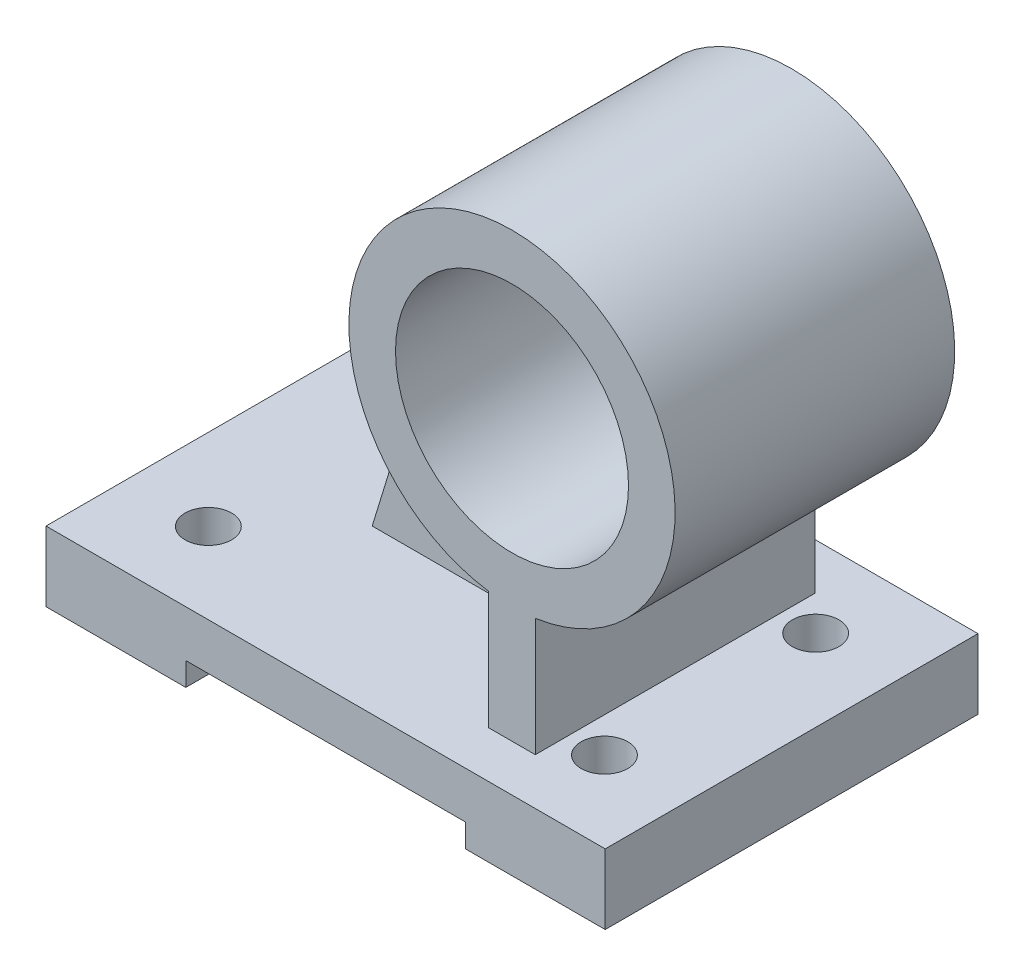
ISO-10303-21;
HEADER;
FILE_DESCRIPTION(('STEP AP214'),'2;1');
FILE_NAME('part.step','',(''),(''),'','','');
FILE_SCHEMA(('AUTOMOTIVE_DESIGN { 1 0 10303 214 1 1 1 1 }'));
ENDSEC;
DATA;
#1=APPLICATION_CONTEXT('core data for automotive mechanical design processes');
#2=APPLICATION_PROTOCOL_DEFINITION('international standard','automotive_design',2000,#1);
#3=PRODUCT_CONTEXT('',#1,'mechanical');
#4=PRODUCT('Part','Part','',(#3));
#5=PRODUCT_RELATED_PRODUCT_CATEGORY('part','',(#4));
#6=PRODUCT_DEFINITION_FORMATION('','',#4);
#7=PRODUCT_DEFINITION_CONTEXT('part definition',#1,'design');
#8=PRODUCT_DEFINITION('design','',#6,#7);
#9=PRODUCT_DEFINITION_SHAPE('','',#8);
#10=(LENGTH_UNIT() NAMED_UNIT(*) SI_UNIT(.MILLI.,.METRE.));
#11=(NAMED_UNIT(*) PLANE_ANGLE_UNIT() SI_UNIT($,.RADIAN.));
#12=(NAMED_UNIT(*) SI_UNIT($,.STERADIAN.) SOLID_ANGLE_UNIT());
#13=UNCERTAINTY_MEASURE_WITH_UNIT(LENGTH_MEASURE(1.E-05),#10,'distance_accuracy_value','');
#14=(GEOMETRIC_REPRESENTATION_CONTEXT(3) GLOBAL_UNCERTAINTY_ASSIGNED_CONTEXT((#13)) GLOBAL_UNIT_ASSIGNED_CONTEXT((#10,
#11,#12)) REPRESENTATION_CONTEXT('',''));
#15=CARTESIAN_POINT('',(0.,0.,0.));
#16=DIRECTION('',(0.,0.,1.));
#17=DIRECTION('',(1.,0.,0.));
#18=AXIS2_PLACEMENT_3D('',#15,#16,#17);
#19=CARTESIAN_POINT('',(25.,7.5,0.));
#20=DIRECTION('',(-1.,0.,0.));
#21=DIRECTION('',(0.,-1.,0.));
#22=AXIS2_PLACEMENT_3D('',#19,#20,#21);
#23=PLANE('',#22);
#24=DIRECTION('',(0.,0.,1.));
#25=VECTOR('',#24,1.);
#26=CARTESIAN_POINT('',(25.,7.5,0.));
#27=LINE('',#26,#25);
#28=CARTESIAN_POINT('',(25.,7.5,-30.));
#29=VERTEX_POINT('',#28);
#30=CARTESIAN_POINT('',(25.,7.5,-5.));
#31=VERTEX_POINT('',#30);
#32=EDGE_CURVE('E305',#29,#31,#27,.T.);
#33=ORIENTED_EDGE('',*,*,#32,.T.);
#34=DIRECTION('',(0.,1.,0.));
#35=VECTOR('',#34,1.);
#36=CARTESIAN_POINT('',(25.,7.5,-5.));
#37=LINE('',#36,#35);
#38=CARTESIAN_POINT('',(25.,32.8589838486224,-5.));
#39=VERTEX_POINT('',#38);
#40=EDGE_CURVE('E172',#31,#39,#37,.T.);
#41=ORIENTED_EDGE('',*,*,#40,.T.);
#42=DIRECTION('',(0.,0.,-1.));
#43=VECTOR('',#42,1.);
#44=CARTESIAN_POINT('',(25.,32.8589838486224,30.));
#45=LINE('',#44,#43);
#46=CARTESIAN_POINT('',(25.,32.8589838486224,-30.));
#47=VERTEX_POINT('',#46);
#48=EDGE_CURVE('E299',#39,#47,#45,.T.);
#49=ORIENTED_EDGE('',*,*,#48,.T.);
#50=DIRECTION('',(0.,1.,0.));
#51=VECTOR('',#50,1.);
#52=CARTESIAN_POINT('',(25.,65.9644736669432,-30.));
#53=LINE('',#52,#51);
#54=EDGE_CURVE('E289',#47,#29,#53,.F.);
#55=ORIENTED_EDGE('',*,*,#54,.T.);
#56=EDGE_LOOP('',(#33,#41,#49,#55));
#57=FACE_BOUND('',#56,.T.);
#58=ADVANCED_FACE('F39',(#57),#23,.T.);
#59=CARTESIAN_POINT('',(30.,67.5,-30.));
#60=DIRECTION('',(0.,0.,-1.));
#61=DIRECTION('',(-1.,0.,0.));
#62=AXIS2_PLACEMENT_3D('',#59,#60,#61);
#63=PLANE('',#62);
#64=CARTESIAN_POINT('',(30.,67.5,-30.));
#65=DIRECTION('',(0.,0.,1.));
#66=DIRECTION('',(1.,0.,0.));
#67=AXIS2_PLACEMENT_3D('',#64,#65,#66);
#68=CIRCLE('',#67,25.);
#69=CARTESIAN_POINT('',(55.,67.5,-30.));
#70=VERTEX_POINT('',#69);
#71=EDGE_CURVE('E420',#70,#70,#68,.T.);
#72=ORIENTED_EDGE('',*,*,#71,.T.);
#73=EDGE_LOOP('',(#72));
#74=FACE_BOUND('',#73,.T.);
#75=CARTESIAN_POINT('',(30.,67.5,-30.));
#76=DIRECTION('',(0.,0.,-1.));
#77=DIRECTION('',(-1.,0.,0.));
#78=AXIS2_PLACEMENT_3D('',#75,#76,#77);
#79=CIRCLE('',#78,35.);
#80=CARTESIAN_POINT('',(35.,32.8589838486224,-30.));
#81=VERTEX_POINT('',#80);
#82=EDGE_CURVE('E43',#47,#81,#79,.T.);
#83=ORIENTED_EDGE('',*,*,#82,.T.);
#84=DIRECTION('',(0.,1.,0.));
#85=VECTOR('',#84,1.);
#86=CARTESIAN_POINT('',(35.,65.9644736669432,-30.));
#87=LINE('',#86,#85);
#88=CARTESIAN_POINT('',(35.,7.5,-30.));
#89=VERTEX_POINT('',#88);
#90=EDGE_CURVE('E273',#89,#81,#87,.T.);
#91=ORIENTED_EDGE('',*,*,#90,.F.);
#92=DIRECTION('',(1.,0.,0.));
#93=VECTOR('',#92,1.);
#94=CARTESIAN_POINT('',(30.,7.5,-30.));
#95=LINE('',#94,#93);
#96=EDGE_CURVE('E49',#29,#89,#95,.T.);
#97=ORIENTED_EDGE('',*,*,#96,.F.);
#98=ORIENTED_EDGE('',*,*,#54,.F.);
#99=EDGE_LOOP('',(#83,#91,#97,#98));
#100=FACE_BOUND('',#99,.T.);
#101=ADVANCED_FACE('F326',(#74,#100),#63,.T.);
#102=CARTESIAN_POINT('',(35.,7.5,0.));
#103=DIRECTION('',(1.,0.,0.));
#104=DIRECTION('',(0.,1.,0.));
#105=AXIS2_PLACEMENT_3D('',#102,#103,#104);
#106=PLANE('',#105);
#107=DIRECTION('',(0.,1.,0.));
#108=VECTOR('',#107,1.);
#109=CARTESIAN_POINT('',(35.,65.9644736669432,30.));
#110=LINE('',#109,#108);
#111=CARTESIAN_POINT('',(35.,7.5,30.));
#112=VERTEX_POINT('',#111);
#113=CARTESIAN_POINT('',(35.,32.8589838486224,30.));
#114=VERTEX_POINT('',#113);
#115=EDGE_CURVE('E284',#112,#114,#110,.T.);
#116=ORIENTED_EDGE('',*,*,#115,.F.);
#117=DIRECTION('',(0.,0.,1.));
#118=VECTOR('',#117,1.);
#119=CARTESIAN_POINT('',(35.,7.5,0.));
#120=LINE('',#119,#118);
#121=EDGE_CURVE('E11',#89,#112,#120,.T.);
#122=ORIENTED_EDGE('',*,*,#121,.F.);
#123=ORIENTED_EDGE('',*,*,#90,.T.);
#124=DIRECTION('',(0.,0.,-1.));
#125=VECTOR('',#124,1.);
#126=CARTESIAN_POINT('',(35.,32.8589838486224,30.));
#127=LINE('',#126,#125);
#128=EDGE_CURVE('E315',#81,#114,#127,.F.);
#129=ORIENTED_EDGE('',*,*,#128,.T.);
#130=EDGE_LOOP('',(#116,#122,#123,#129));
#131=FACE_BOUND('',#130,.T.);
#132=ADVANCED_FACE('F331',(#131),#106,.T.);
#133=DIRECTION('',(0.,1.,0.));
#134=VECTOR('',#133,1.);
#135=CARTESIAN_POINT('',(25.,7.5,5.));
#136=LINE('',#135,#134);
#137=CARTESIAN_POINT('',(25.,7.5,5.));
#138=VERTEX_POINT('',#137);
#139=CARTESIAN_POINT('',(25.,32.8589838486224,5.));
#140=VERTEX_POINT('',#139);
#141=EDGE_CURVE('E195',#138,#140,#136,.T.);
#142=ORIENTED_EDGE('',*,*,#141,.F.);
#143=CARTESIAN_POINT('',(25.,7.5,30.));
#144=VERTEX_POINT('',#143);
#145=EDGE_CURVE('E294',#138,#144,#27,.T.);
#146=ORIENTED_EDGE('',*,*,#145,.T.);
#147=DIRECTION('',(0.,1.,0.));
#148=VECTOR('',#147,1.);
#149=CARTESIAN_POINT('',(25.,65.9644736669432,30.));
#150=LINE('',#149,#148);
#151=CARTESIAN_POINT('',(25.,32.8589838486224,30.));
#152=VERTEX_POINT('',#151);
#153=EDGE_CURVE('E288',#152,#144,#150,.F.);
#154=ORIENTED_EDGE('',*,*,#153,.F.);
#155=EDGE_CURVE('E311',#152,#140,#45,.T.);
#156=ORIENTED_EDGE('',*,*,#155,.T.);
#157=EDGE_LOOP('',(#142,#146,#154,#156));
#158=FACE_BOUND('',#157,.T.);
#159=ADVANCED_FACE('F334',(#158),#23,.T.);
#160=CARTESIAN_POINT('',(30.,67.5,30.));
#161=DIRECTION('',(0.,0.,-1.));
#162=DIRECTION('',(-1.,0.,0.));
#163=AXIS2_PLACEMENT_3D('',#160,#161,#162);
#164=CYLINDRICAL_SURFACE('',#163,35.);
#165=CARTESIAN_POINT('',(30.,67.5,30.));
#166=DIRECTION('',(0.,0.,-1.));
#167=DIRECTION('',(-1.,0.,0.));
#168=AXIS2_PLACEMENT_3D('',#165,#166,#167);
#169=CIRCLE('',#168,35.);
#170=EDGE_CURVE('E295',#152,#114,#169,.T.);
#171=ORIENTED_EDGE('',*,*,#170,.T.);
#172=ORIENTED_EDGE('',*,*,#128,.F.);
#173=ORIENTED_EDGE('',*,*,#82,.F.);
#174=ORIENTED_EDGE('',*,*,#48,.F.);
#175=CARTESIAN_POINT('',(30.,67.5,-5.));
#176=DIRECTION('',(0.,0.,1.));
#177=DIRECTION('',(1.,0.,0.));
#178=AXIS2_PLACEMENT_3D('',#175,#176,#177);
#179=CIRCLE('',#178,35.);
#180=CARTESIAN_POINT('',(-3.46307227099476,77.7578162484118,-5.));
#181=VERTEX_POINT('',#180);
#182=EDGE_CURVE('E62',#39,#181,#179,.F.);
#183=ORIENTED_EDGE('',*,*,#182,.T.);
#184=DIRECTION('',(0.,0.,-1.));
#185=VECTOR('',#184,1.);
#186=CARTESIAN_POINT('',(-3.46307227099475,77.7578162484118,30.));
#187=LINE('',#186,#185);
#188=CARTESIAN_POINT('',(-3.46307227099476,77.7578162484118,5.));
#189=VERTEX_POINT('',#188);
#190=EDGE_CURVE('E57',#189,#181,#187,.T.);
#191=ORIENTED_EDGE('',*,*,#190,.F.);
#192=CARTESIAN_POINT('',(30.,67.5,5.));
#193=DIRECTION('',(0.,0.,1.));
#194=DIRECTION('',(1.,0.,0.));
#195=AXIS2_PLACEMENT_3D('',#192,#193,#194);
#196=CIRCLE('',#195,35.);
#197=EDGE_CURVE('E174',#140,#189,#196,.F.);
#198=ORIENTED_EDGE('',*,*,#197,.F.);
#199=ORIENTED_EDGE('',*,*,#155,.F.);
#200=EDGE_LOOP('',(#171,#172,#173,#174,#183,#191,#198,#199));
#201=FACE_BOUND('',#200,.T.);
#202=ADVANCED_FACE('F41',(#201),#164,.T.);
#203=CARTESIAN_POINT('',(30.,67.5,30.));
#204=DIRECTION('',(0.,0.,-1.));
#205=DIRECTION('',(-1.,0.,0.));
#206=AXIS2_PLACEMENT_3D('',#203,#204,#205);
#207=PLANE('',#206);
#208=CARTESIAN_POINT('',(30.,67.5,30.));
#209=DIRECTION('',(0.,0.,1.));
#210=DIRECTION('',(1.,0.,0.));
#211=AXIS2_PLACEMENT_3D('',#208,#209,#210);
#212=CIRCLE('',#211,25.);
#213=CARTESIAN_POINT('',(55.,67.5,30.));
#214=VERTEX_POINT('',#213);
#215=EDGE_CURVE('E423',#214,#214,#212,.T.);
#216=ORIENTED_EDGE('',*,*,#215,.F.);
#217=EDGE_LOOP('',(#216));
#218=FACE_BOUND('',#217,.T.);
#219=ORIENTED_EDGE('',*,*,#170,.F.);
#220=ORIENTED_EDGE('',*,*,#153,.T.);
#221=DIRECTION('',(1.,0.,0.));
#222=VECTOR('',#221,1.);
#223=CARTESIAN_POINT('',(30.,7.5,30.));
#224=LINE('',#223,#222);
#225=EDGE_CURVE('E290',#144,#112,#224,.T.);
#226=ORIENTED_EDGE('',*,*,#225,.T.);
#227=ORIENTED_EDGE('',*,*,#115,.T.);
#228=EDGE_LOOP('',(#219,#220,#226,#227));
#229=FACE_BOUND('',#228,.T.);
#230=ADVANCED_FACE('F333',(#218,#229),#207,.F.);
#231=CARTESIAN_POINT('',(-60.,7.5,40.));
#232=DIRECTION('',(0.,-1.,0.));
#233=DIRECTION('',(0.,0.,-1.));
#234=AXIS2_PLACEMENT_3D('',#231,#232,#233);
#235=PLANE('',#234);
#236=CARTESIAN_POINT('',(42.5,7.5,-22.6578896149476));
#237=DIRECTION('',(0.,1.,0.));
#238=DIRECTION('',(0.,0.,-1.));
#239=AXIS2_PLACEMENT_3D('',#236,#237,#238);
#240=CIRCLE('',#239,5.);
#241=CARTESIAN_POINT('',(42.5,7.5,-27.6578896149476));
#242=VERTEX_POINT('',#241);
#243=EDGE_CURVE('E427',#242,#242,#240,.T.);
#244=ORIENTED_EDGE('',*,*,#243,.F.);
#245=EDGE_LOOP('',(#244));
#246=FACE_BOUND('',#245,.T.);
#247=CARTESIAN_POINT('',(42.5,7.5,22.6578896149476));
#248=DIRECTION('',(0.,-1.,0.));
#249=DIRECTION('',(0.,0.,1.));
#250=AXIS2_PLACEMENT_3D('',#247,#248,#249);
#251=CIRCLE('',#250,5.);
#252=CARTESIAN_POINT('',(42.5,7.5,27.6578896149476));
#253=VERTEX_POINT('',#252);
#254=EDGE_CURVE('E434',#253,#253,#251,.T.);
#255=ORIENTED_EDGE('',*,*,#254,.T.);
#256=EDGE_LOOP('',(#255));
#257=FACE_BOUND('',#256,.T.);
#258=CARTESIAN_POINT('',(-42.5,7.5,-22.6578896149476));
#259=DIRECTION('',(0.,-1.,0.));
#260=DIRECTION('',(0.,0.,-1.));
#261=AXIS2_PLACEMENT_3D('',#258,#259,#260);
#262=CIRCLE('',#261,5.);
#263=CARTESIAN_POINT('',(-42.5,7.5,-27.6578896149476));
#264=VERTEX_POINT('',#263);
#265=EDGE_CURVE('E442',#264,#264,#262,.T.);
#266=ORIENTED_EDGE('',*,*,#265,.T.);
#267=EDGE_LOOP('',(#266));
#268=FACE_BOUND('',#267,.T.);
#269=CARTESIAN_POINT('',(-42.5,7.5,22.6578896149476));
#270=DIRECTION('',(0.,1.,0.));
#271=DIRECTION('',(0.,0.,1.));
#272=AXIS2_PLACEMENT_3D('',#269,#270,#271);
#273=CIRCLE('',#272,5.);
#274=CARTESIAN_POINT('',(-42.5,7.5,27.6578896149476));
#275=VERTEX_POINT('',#274);
#276=EDGE_CURVE('E185',#275,#275,#273,.T.);
#277=ORIENTED_EDGE('',*,*,#276,.F.);
#278=EDGE_LOOP('',(#277));
#279=FACE_BOUND('',#278,.T.);
#280=ORIENTED_EDGE('',*,*,#121,.T.);
#281=ORIENTED_EDGE('',*,*,#225,.F.);
#282=ORIENTED_EDGE('',*,*,#145,.F.);
#283=DIRECTION('',(-1.,0.,0.));
#284=VECTOR('',#283,1.);
#285=CARTESIAN_POINT('',(-60.,7.5,5.));
#286=LINE('',#285,#284);
#287=CARTESIAN_POINT('',(-25.,7.5,5.));
#288=VERTEX_POINT('',#287);
#289=EDGE_CURVE('E160',#138,#288,#286,.T.);
#290=ORIENTED_EDGE('',*,*,#289,.T.);
#291=DIRECTION('',(0.,0.,1.));
#292=VECTOR('',#291,1.);
#293=CARTESIAN_POINT('',(-25.,7.5,40.));
#294=LINE('',#293,#292);
#295=CARTESIAN_POINT('',(-25.,7.5,-5.));
#296=VERTEX_POINT('',#295);
#297=EDGE_CURVE('E152',#288,#296,#294,.F.);
#298=ORIENTED_EDGE('',*,*,#297,.T.);
#299=DIRECTION('',(-1.,0.,0.));
#300=VECTOR('',#299,1.);
#301=CARTESIAN_POINT('',(-60.,7.5,-5.));
#302=LINE('',#301,#300);
#303=EDGE_CURVE('E156',#31,#296,#302,.T.);
#304=ORIENTED_EDGE('',*,*,#303,.F.);
#305=ORIENTED_EDGE('',*,*,#32,.F.);
#306=ORIENTED_EDGE('',*,*,#96,.T.);
#307=EDGE_LOOP('',(#280,#281,#282,#290,#298,#304,#305,#306));
#308=FACE_BOUND('',#307,.T.);
#309=DIRECTION('',(0.,0.,-1.));
#310=VECTOR('',#309,1.);
#311=CARTESIAN_POINT('',(60.,7.5,40.));
#312=LINE('',#311,#310);
#313=CARTESIAN_POINT('',(60.,7.5,40.));
#314=VERTEX_POINT('',#313);
#315=CARTESIAN_POINT('',(60.,7.5,-40.));
#316=VERTEX_POINT('',#315);
#317=EDGE_CURVE('E203',#314,#316,#312,.T.);
#318=ORIENTED_EDGE('',*,*,#317,.T.);
#319=DIRECTION('',(-1.,0.,0.));
#320=VECTOR('',#319,1.);
#321=CARTESIAN_POINT('',(-60.,7.5,-40.));
#322=LINE('',#321,#320);
#323=CARTESIAN_POINT('',(-60.,7.5,-40.));
#324=VERTEX_POINT('',#323);
#325=EDGE_CURVE('E227',#316,#324,#322,.T.);
#326=ORIENTED_EDGE('',*,*,#325,.T.);
#327=DIRECTION('',(0.,0.,-1.));
#328=VECTOR('',#327,1.);
#329=CARTESIAN_POINT('',(-60.,7.5,40.));
#330=LINE('',#329,#328);
#331=CARTESIAN_POINT('',(-60.,7.5,40.));
#332=VERTEX_POINT('',#331);
#333=EDGE_CURVE('E206',#332,#324,#330,.T.);
#334=ORIENTED_EDGE('',*,*,#333,.F.);
#335=DIRECTION('',(-1.,0.,0.));
#336=VECTOR('',#335,1.);
#337=CARTESIAN_POINT('',(-60.,7.5,40.));
#338=LINE('',#337,#336);
#339=EDGE_CURVE('E242',#314,#332,#338,.T.);
#340=ORIENTED_EDGE('',*,*,#339,.F.);
#341=EDGE_LOOP('',(#318,#326,#334,#340));
#342=FACE_BOUND('',#341,.T.);
#343=ADVANCED_FACE('F154',(#246,#257,#268,#279,#308,#342),#235,.F.);
#344=CARTESIAN_POINT('',(-60.,-7.5,40.));
#345=DIRECTION('',(0.,1.,0.));
#346=DIRECTION('',(0.,0.,1.));
#347=AXIS2_PLACEMENT_3D('',#344,#345,#346);
#348=PLANE('',#347);
#349=CARTESIAN_POINT('',(42.5,-7.5,-22.6578896149476));
#350=DIRECTION('',(0.,1.,0.));
#351=DIRECTION('',(0.,0.,-1.));
#352=AXIS2_PLACEMENT_3D('',#349,#350,#351);
#353=CIRCLE('',#352,5.);
#354=CARTESIAN_POINT('',(42.5,-7.5,-27.6578896149476));
#355=VERTEX_POINT('',#354);
#356=EDGE_CURVE('E430',#355,#355,#353,.T.);
#357=ORIENTED_EDGE('',*,*,#356,.T.);
#358=EDGE_LOOP('',(#357));
#359=FACE_BOUND('',#358,.T.);
#360=CARTESIAN_POINT('',(42.5,-7.5,22.6578896149476));
#361=DIRECTION('',(0.,-1.,0.));
#362=DIRECTION('',(0.,0.,1.));
#363=AXIS2_PLACEMENT_3D('',#360,#361,#362);
#364=CIRCLE('',#363,5.);
#365=CARTESIAN_POINT('',(42.5,-7.5,27.6578896149476));
#366=VERTEX_POINT('',#365);
#367=EDGE_CURVE('E438',#366,#366,#364,.T.);
#368=ORIENTED_EDGE('',*,*,#367,.F.);
#369=EDGE_LOOP('',(#368));
#370=FACE_BOUND('',#369,.T.);
#371=DIRECTION('',(1.,0.,0.));
#372=VECTOR('',#371,1.);
#373=CARTESIAN_POINT('',(-60.,-7.5,40.));
#374=LINE('',#373,#372);
#375=CARTESIAN_POINT('',(30.,-7.5,40.));
#376=VERTEX_POINT('',#375);
#377=CARTESIAN_POINT('',(60.,-7.5,40.));
#378=VERTEX_POINT('',#377);
#379=EDGE_CURVE('E238',#376,#378,#374,.T.);
#380=ORIENTED_EDGE('',*,*,#379,.F.);
#381=DIRECTION('',(0.,0.,1.));
#382=VECTOR('',#381,1.);
#383=CARTESIAN_POINT('',(30.,-7.5,-40.));
#384=LINE('',#383,#382);
#385=CARTESIAN_POINT('',(30.,-7.5,-40.));
#386=VERTEX_POINT('',#385);
#387=EDGE_CURVE('E234',#386,#376,#384,.T.);
#388=ORIENTED_EDGE('',*,*,#387,.F.);
#389=DIRECTION('',(1.,0.,0.));
#390=VECTOR('',#389,1.);
#391=CARTESIAN_POINT('',(-60.,-7.5,-40.));
#392=LINE('',#391,#390);
#393=CARTESIAN_POINT('',(60.,-7.5,-40.));
#394=VERTEX_POINT('',#393);
#395=EDGE_CURVE('E222',#386,#394,#392,.T.);
#396=ORIENTED_EDGE('',*,*,#395,.T.);
#397=DIRECTION('',(0.,0.,-1.));
#398=VECTOR('',#397,1.);
#399=CARTESIAN_POINT('',(60.,-7.5,40.));
#400=LINE('',#399,#398);
#401=EDGE_CURVE('E214',#378,#394,#400,.T.);
#402=ORIENTED_EDGE('',*,*,#401,.F.);
#403=EDGE_LOOP('',(#380,#388,#396,#402));
#404=FACE_BOUND('',#403,.T.);
#405=ADVANCED_FACE('F344',(#359,#370,#404),#348,.F.);
#406=CARTESIAN_POINT('',(60.,-7.5,40.));
#407=DIRECTION('',(-1.,0.,0.));
#408=DIRECTION('',(0.,0.,1.));
#409=AXIS2_PLACEMENT_3D('',#406,#407,#408);
#410=PLANE('',#409);
#411=ORIENTED_EDGE('',*,*,#401,.T.);
#412=DIRECTION('',(0.,1.,0.));
#413=VECTOR('',#412,1.);
#414=CARTESIAN_POINT('',(60.,-7.5,-40.));
#415=LINE('',#414,#413);
#416=EDGE_CURVE('E230',#394,#316,#415,.T.);
#417=ORIENTED_EDGE('',*,*,#416,.T.);
#418=ORIENTED_EDGE('',*,*,#317,.F.);
#419=DIRECTION('',(0.,1.,0.));
#420=VECTOR('',#419,1.);
#421=CARTESIAN_POINT('',(60.,-7.5,40.));
#422=LINE('',#421,#420);
#423=EDGE_CURVE('E223',#378,#314,#422,.T.);
#424=ORIENTED_EDGE('',*,*,#423,.F.);
#425=EDGE_LOOP('',(#411,#417,#418,#424));
#426=FACE_BOUND('',#425,.T.);
#427=ADVANCED_FACE('F383',(#426),#410,.F.);
#428=CARTESIAN_POINT('',(-60.,-7.5,40.));
#429=DIRECTION('',(1.,0.,0.));
#430=DIRECTION('',(0.,0.,-1.));
#431=AXIS2_PLACEMENT_3D('',#428,#429,#430);
#432=PLANE('',#431);
#433=DIRECTION('',(0.,-1.,0.));
#434=VECTOR('',#433,1.);
#435=CARTESIAN_POINT('',(-60.,-7.5,-40.));
#436=LINE('',#435,#434);
#437=CARTESIAN_POINT('',(-60.,-7.5,-40.));
#438=VERTEX_POINT('',#437);
#439=EDGE_CURVE('E224',#324,#438,#436,.T.);
#440=ORIENTED_EDGE('',*,*,#439,.T.);
#441=DIRECTION('',(0.,0.,-1.));
#442=VECTOR('',#441,1.);
#443=CARTESIAN_POINT('',(-60.,-7.5,40.));
#444=LINE('',#443,#442);
#445=CARTESIAN_POINT('',(-60.,-7.5,40.));
#446=VERTEX_POINT('',#445);
#447=EDGE_CURVE('E210',#446,#438,#444,.T.);
#448=ORIENTED_EDGE('',*,*,#447,.F.);
#449=DIRECTION('',(0.,-1.,0.));
#450=VECTOR('',#449,1.);
#451=CARTESIAN_POINT('',(-60.,-7.5,40.));
#452=LINE('',#451,#450);
#453=EDGE_CURVE('E239',#332,#446,#452,.T.);
#454=ORIENTED_EDGE('',*,*,#453,.F.);
#455=ORIENTED_EDGE('',*,*,#333,.T.);
#456=EDGE_LOOP('',(#440,#448,#454,#455));
#457=FACE_BOUND('',#456,.T.);
#458=ADVANCED_FACE('F379',(#457),#432,.F.);
#459=CARTESIAN_POINT('',(-42.5,-7.5,-22.6578896149476));
#460=DIRECTION('',(0.,-1.,0.));
#461=DIRECTION('',(0.,0.,-1.));
#462=AXIS2_PLACEMENT_3D('',#459,#460,#461);
#463=CIRCLE('',#462,5.);
#464=CARTESIAN_POINT('',(-42.5,-7.5,-27.6578896149476));
#465=VERTEX_POINT('',#464);
#466=EDGE_CURVE('E446',#465,#465,#463,.T.);
#467=ORIENTED_EDGE('',*,*,#466,.F.);
#468=EDGE_LOOP('',(#467));
#469=FACE_BOUND('',#468,.T.);
#470=CARTESIAN_POINT('',(-42.5,-7.5,22.6578896149476));
#471=DIRECTION('',(0.,1.,0.));
#472=DIRECTION('',(0.,0.,1.));
#473=AXIS2_PLACEMENT_3D('',#470,#471,#472);
#474=CIRCLE('',#473,5.);
#475=CARTESIAN_POINT('',(-42.5,-7.5,27.6578896149476));
#476=VERTEX_POINT('',#475);
#477=EDGE_CURVE('E179',#476,#476,#474,.T.);
#478=ORIENTED_EDGE('',*,*,#477,.T.);
#479=EDGE_LOOP('',(#478));
#480=FACE_BOUND('',#479,.T.);
#481=CARTESIAN_POINT('',(-30.,-7.50000000000001,-40.));
#482=VERTEX_POINT('',#481);
#483=EDGE_CURVE('E218',#438,#482,#392,.T.);
#484=ORIENTED_EDGE('',*,*,#483,.T.);
#485=DIRECTION('',(0.,0.,1.));
#486=VECTOR('',#485,1.);
#487=CARTESIAN_POINT('',(-30.,-7.50000000000001,-40.));
#488=LINE('',#487,#486);
#489=CARTESIAN_POINT('',(-30.,-7.50000000000001,40.));
#490=VERTEX_POINT('',#489);
#491=EDGE_CURVE('E255',#482,#490,#488,.T.);
#492=ORIENTED_EDGE('',*,*,#491,.T.);
#493=EDGE_CURVE('E217',#446,#490,#374,.T.);
#494=ORIENTED_EDGE('',*,*,#493,.F.);
#495=ORIENTED_EDGE('',*,*,#447,.T.);
#496=EDGE_LOOP('',(#484,#492,#494,#495));
#497=FACE_BOUND('',#496,.T.);
#498=ADVANCED_FACE('F372',(#469,#480,#497),#348,.F.);
#499=CARTESIAN_POINT('',(0.,0.,40.));
#500=DIRECTION('',(0.,0.,-1.));
#501=DIRECTION('',(-1.,0.,0.));
#502=AXIS2_PLACEMENT_3D('',#499,#500,#501);
#503=PLANE('',#502);
#504=DIRECTION('',(-1.,0.,0.));
#505=VECTOR('',#504,1.);
#506=CARTESIAN_POINT('',(30.,-2.5,40.));
#507=LINE('',#506,#505);
#508=CARTESIAN_POINT('',(30.,-2.5,40.));
#509=VERTEX_POINT('',#508);
#510=CARTESIAN_POINT('',(-30.,-2.50000000000001,40.));
#511=VERTEX_POINT('',#510);
#512=EDGE_CURVE('E264',#509,#511,#507,.T.);
#513=ORIENTED_EDGE('',*,*,#512,.F.);
#514=DIRECTION('',(0.,1.,0.));
#515=VECTOR('',#514,1.);
#516=CARTESIAN_POINT('',(30.,-7.5,40.));
#517=LINE('',#516,#515);
#518=EDGE_CURVE('E269',#376,#509,#517,.T.);
#519=ORIENTED_EDGE('',*,*,#518,.F.);
#520=ORIENTED_EDGE('',*,*,#379,.T.);
#521=ORIENTED_EDGE('',*,*,#423,.T.);
#522=ORIENTED_EDGE('',*,*,#339,.T.);
#523=ORIENTED_EDGE('',*,*,#453,.T.);
#524=ORIENTED_EDGE('',*,*,#493,.T.);
#525=DIRECTION('',(0.,-1.,0.));
#526=VECTOR('',#525,1.);
#527=CARTESIAN_POINT('',(-30.,-7.50000000000001,40.));
#528=LINE('',#527,#526);
#529=EDGE_CURVE('E261',#511,#490,#528,.T.);
#530=ORIENTED_EDGE('',*,*,#529,.F.);
#531=EDGE_LOOP('',(#513,#519,#520,#521,#522,#523,#524,#530));
#532=FACE_BOUND('',#531,.T.);
#533=ADVANCED_FACE('F369',(#532),#503,.F.);
#534=CARTESIAN_POINT('',(0.,0.,-40.));
#535=DIRECTION('',(0.,0.,-1.));
#536=DIRECTION('',(-1.,0.,0.));
#537=AXIS2_PLACEMENT_3D('',#534,#535,#536);
#538=PLANE('',#537);
#539=DIRECTION('',(0.,1.,0.));
#540=VECTOR('',#539,1.);
#541=CARTESIAN_POINT('',(30.,-7.5,-40.));
#542=LINE('',#541,#540);
#543=CARTESIAN_POINT('',(30.,-2.5,-40.));
#544=VERTEX_POINT('',#543);
#545=EDGE_CURVE('E265',#386,#544,#542,.T.);
#546=ORIENTED_EDGE('',*,*,#545,.T.);
#547=DIRECTION('',(-1.,0.,0.));
#548=VECTOR('',#547,1.);
#549=CARTESIAN_POINT('',(30.,-2.5,-40.));
#550=LINE('',#549,#548);
#551=CARTESIAN_POINT('',(-30.,-2.50000000000001,-40.));
#552=VERTEX_POINT('',#551);
#553=EDGE_CURVE('E277',#544,#552,#550,.T.);
#554=ORIENTED_EDGE('',*,*,#553,.T.);
#555=DIRECTION('',(0.,-1.,0.));
#556=VECTOR('',#555,1.);
#557=CARTESIAN_POINT('',(-30.,-7.50000000000001,-40.));
#558=LINE('',#557,#556);
#559=EDGE_CURVE('E251',#552,#482,#558,.T.);
#560=ORIENTED_EDGE('',*,*,#559,.T.);
#561=ORIENTED_EDGE('',*,*,#483,.F.);
#562=ORIENTED_EDGE('',*,*,#439,.F.);
#563=ORIENTED_EDGE('',*,*,#325,.F.);
#564=ORIENTED_EDGE('',*,*,#416,.F.);
#565=ORIENTED_EDGE('',*,*,#395,.F.);
#566=EDGE_LOOP('',(#546,#554,#560,#561,#562,#563,#564,#565));
#567=FACE_BOUND('',#566,.T.);
#568=ADVANCED_FACE('F367',(#567),#538,.T.);
#569=CARTESIAN_POINT('',(30.,-7.5,-40.));
#570=DIRECTION('',(1.,0.,0.));
#571=DIRECTION('',(0.,1.,0.));
#572=AXIS2_PLACEMENT_3D('',#569,#570,#571);
#573=PLANE('',#572);
#574=ORIENTED_EDGE('',*,*,#518,.T.);
#575=DIRECTION('',(0.,0.,1.));
#576=VECTOR('',#575,1.);
#577=CARTESIAN_POINT('',(30.,-2.5,-40.));
#578=LINE('',#577,#576);
#579=EDGE_CURVE('E248',#544,#509,#578,.T.);
#580=ORIENTED_EDGE('',*,*,#579,.F.);
#581=ORIENTED_EDGE('',*,*,#545,.F.);
#582=ORIENTED_EDGE('',*,*,#387,.T.);
#583=EDGE_LOOP('',(#574,#580,#581,#582));
#584=FACE_BOUND('',#583,.T.);
#585=ADVANCED_FACE('F360',(#584),#573,.F.);
#586=CARTESIAN_POINT('',(-30.,-7.50000000000001,-40.));
#587=DIRECTION('',(-1.,0.,0.));
#588=DIRECTION('',(0.,-1.,0.));
#589=AXIS2_PLACEMENT_3D('',#586,#587,#588);
#590=PLANE('',#589);
#591=ORIENTED_EDGE('',*,*,#529,.T.);
#592=ORIENTED_EDGE('',*,*,#491,.F.);
#593=ORIENTED_EDGE('',*,*,#559,.F.);
#594=DIRECTION('',(0.,0.,1.));
#595=VECTOR('',#594,1.);
#596=CARTESIAN_POINT('',(-30.,-2.50000000000001,-40.));
#597=LINE('',#596,#595);
#598=EDGE_CURVE('E252',#552,#511,#597,.T.);
#599=ORIENTED_EDGE('',*,*,#598,.T.);
#600=EDGE_LOOP('',(#591,#592,#593,#599));
#601=FACE_BOUND('',#600,.T.);
#602=ADVANCED_FACE('F356',(#601),#590,.F.);
#603=CARTESIAN_POINT('',(30.,-2.5,-40.));
#604=DIRECTION('',(0.,1.,0.));
#605=DIRECTION('',(-1.,0.,0.));
#606=AXIS2_PLACEMENT_3D('',#603,#604,#605);
#607=PLANE('',#606);
#608=ORIENTED_EDGE('',*,*,#579,.T.);
#609=ORIENTED_EDGE('',*,*,#512,.T.);
#610=ORIENTED_EDGE('',*,*,#598,.F.);
#611=ORIENTED_EDGE('',*,*,#553,.F.);
#612=EDGE_LOOP('',(#608,#609,#610,#611));
#613=FACE_BOUND('',#612,.T.);
#614=ADVANCED_FACE('F359',(#613),#607,.F.);
#615=CARTESIAN_POINT('',(-25.,7.5,0.));
#616=DIRECTION('',(0.956087779171279,-0.293080464240338,0.));
#617=DIRECTION('',(0.293080464240338,0.956087779171279,0.));
#618=AXIS2_PLACEMENT_3D('',#615,#616,#617);
#619=PLANE('',#618);
#620=DIRECTION('',(0.293080464240338,0.956087779171279,0.));
#621=VECTOR('',#620,1.);
#622=CARTESIAN_POINT('',(-25.,7.5,5.));
#623=LINE('',#622,#621);
#624=EDGE_CURVE('E178',#288,#189,#623,.T.);
#625=ORIENTED_EDGE('',*,*,#624,.T.);
#626=ORIENTED_EDGE('',*,*,#190,.T.);
#627=DIRECTION('',(0.293080464240338,0.956087779171279,0.));
#628=VECTOR('',#627,1.);
#629=CARTESIAN_POINT('',(-25.,7.5,-5.));
#630=LINE('',#629,#628);
#631=EDGE_CURVE('E171',#296,#181,#630,.T.);
#632=ORIENTED_EDGE('',*,*,#631,.F.);
#633=ORIENTED_EDGE('',*,*,#297,.F.);
#634=EDGE_LOOP('',(#625,#626,#632,#633));
#635=FACE_BOUND('',#634,.T.);
#636=ADVANCED_FACE('F176',(#635),#619,.F.);
#637=CARTESIAN_POINT('',(2.50000000000002,47.5,5.));
#638=DIRECTION('',(0.,0.,1.));
#639=DIRECTION('',(1.,0.,0.));
#640=AXIS2_PLACEMENT_3D('',#637,#638,#639);
#641=PLANE('',#640);
#642=ORIENTED_EDGE('',*,*,#289,.F.);
#643=ORIENTED_EDGE('',*,*,#141,.T.);
#644=ORIENTED_EDGE('',*,*,#197,.T.);
#645=ORIENTED_EDGE('',*,*,#624,.F.);
#646=EDGE_LOOP('',(#642,#643,#644,#645));
#647=FACE_BOUND('',#646,.T.);
#648=ADVANCED_FACE('F390',(#647),#641,.T.);
#649=CARTESIAN_POINT('',(2.50000000000002,47.5,-5.));
#650=DIRECTION('',(0.,0.,1.));
#651=DIRECTION('',(1.,0.,0.));
#652=AXIS2_PLACEMENT_3D('',#649,#650,#651);
#653=PLANE('',#652);
#654=ORIENTED_EDGE('',*,*,#40,.F.);
#655=ORIENTED_EDGE('',*,*,#303,.T.);
#656=ORIENTED_EDGE('',*,*,#631,.T.);
#657=ORIENTED_EDGE('',*,*,#182,.F.);
#658=EDGE_LOOP('',(#654,#655,#656,#657));
#659=FACE_BOUND('',#658,.T.);
#660=ADVANCED_FACE('F170',(#659),#653,.F.);
#661=CARTESIAN_POINT('',(-42.5,-7.5,22.6578896149476));
#662=DIRECTION('',(0.,1.,0.));
#663=DIRECTION('',(0.,0.,1.));
#664=AXIS2_PLACEMENT_3D('',#661,#662,#663);
#665=CYLINDRICAL_SURFACE('',#664,5.);
#666=ORIENTED_EDGE('',*,*,#477,.F.);
#667=EDGE_LOOP('',(#666));
#668=FACE_BOUND('',#667,.T.);
#669=ORIENTED_EDGE('',*,*,#276,.T.);
#670=EDGE_LOOP('',(#669));
#671=FACE_BOUND('',#670,.T.);
#672=ADVANCED_FACE('F393',(#668,#671),#665,.F.);
#673=CARTESIAN_POINT('',(-42.5,-7.5,-22.6578896149476));
#674=DIRECTION('',(0.,1.,0.));
#675=DIRECTION('',(0.,0.,1.));
#676=AXIS2_PLACEMENT_3D('',#673,#674,#675);
#677=CYLINDRICAL_SURFACE('',#676,5.);
#678=ORIENTED_EDGE('',*,*,#466,.T.);
#679=EDGE_LOOP('',(#678));
#680=FACE_BOUND('',#679,.T.);
#681=ORIENTED_EDGE('',*,*,#265,.F.);
#682=EDGE_LOOP('',(#681));
#683=FACE_BOUND('',#682,.T.);
#684=ADVANCED_FACE('F399',(#680,#683),#677,.F.);
#685=CARTESIAN_POINT('',(42.5,-7.5,22.6578896149476));
#686=DIRECTION('',(0.,1.,0.));
#687=DIRECTION('',(0.,0.,1.));
#688=AXIS2_PLACEMENT_3D('',#685,#686,#687);
#689=CYLINDRICAL_SURFACE('',#688,5.);
#690=ORIENTED_EDGE('',*,*,#367,.T.);
#691=EDGE_LOOP('',(#690));
#692=FACE_BOUND('',#691,.T.);
#693=ORIENTED_EDGE('',*,*,#254,.F.);
#694=EDGE_LOOP('',(#693));
#695=FACE_BOUND('',#694,.T.);
#696=ADVANCED_FACE('F403',(#692,#695),#689,.F.);
#697=CARTESIAN_POINT('',(42.5,-7.5,-22.6578896149476));
#698=DIRECTION('',(0.,1.,0.));
#699=DIRECTION('',(0.,0.,1.));
#700=AXIS2_PLACEMENT_3D('',#697,#698,#699);
#701=CYLINDRICAL_SURFACE('',#700,5.);
#702=ORIENTED_EDGE('',*,*,#356,.F.);
#703=EDGE_LOOP('',(#702));
#704=FACE_BOUND('',#703,.T.);
#705=ORIENTED_EDGE('',*,*,#243,.T.);
#706=EDGE_LOOP('',(#705));
#707=FACE_BOUND('',#706,.T.);
#708=ADVANCED_FACE('F407',(#704,#707),#701,.F.);
#709=CARTESIAN_POINT('',(30.,67.5,-30.));
#710=DIRECTION('',(0.,0.,1.));
#711=DIRECTION('',(1.,0.,0.));
#712=AXIS2_PLACEMENT_3D('',#709,#710,#711);
#713=CYLINDRICAL_SURFACE('',#712,25.);
#714=ORIENTED_EDGE('',*,*,#71,.F.);
#715=EDGE_LOOP('',(#714));
#716=FACE_BOUND('',#715,.T.);
#717=ORIENTED_EDGE('',*,*,#215,.T.);
#718=EDGE_LOOP('',(#717));
#719=FACE_BOUND('',#718,.T.);
#720=ADVANCED_FACE('F411',(#716,#719),#713,.F.);
#721=CLOSED_SHELL('',(#58,#101,#132,#159,#202,#230,#343,#405,#427,#458,#498,#533,#568,#585,#602,
#614,#636,#648,#660,#672,#684,#696,#708,#720));
#722=MANIFOLD_SOLID_BREP('B2',#721);
#723=ADVANCED_BREP_SHAPE_REPRESENTATION('',(#18,#722),#14);
#724=SHAPE_DEFINITION_REPRESENTATION(#9,#723);
ENDSEC;
END-ISO-10303-21;
